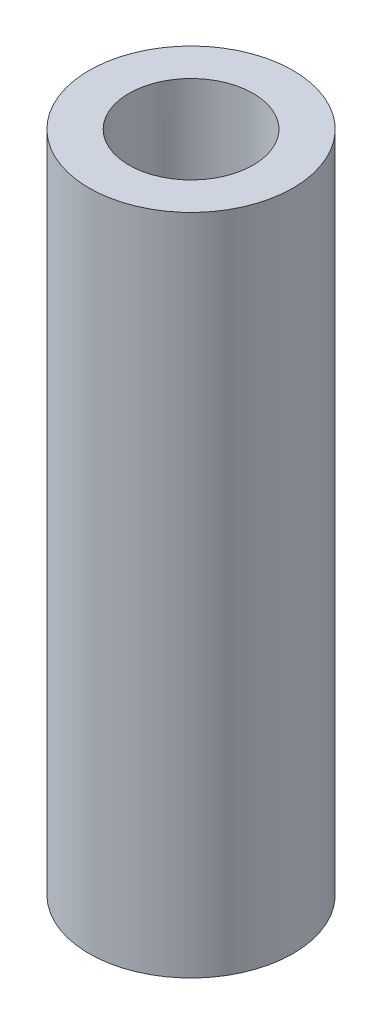
ISO-10303-21;
HEADER;
FILE_DESCRIPTION(('STEP AP214'),'2;1');
FILE_NAME('part.step','',(''),(''),'','','');
FILE_SCHEMA(('AUTOMOTIVE_DESIGN { 1 0 10303 214 1 1 1 1 }'));
ENDSEC;
DATA;
#1=APPLICATION_CONTEXT('core data for automotive mechanical design processes');
#2=APPLICATION_PROTOCOL_DEFINITION('international standard','automotive_design',2000,#1);
#3=PRODUCT_CONTEXT('',#1,'mechanical');
#4=PRODUCT('Part','Part','',(#3));
#5=PRODUCT_RELATED_PRODUCT_CATEGORY('part','',(#4));
#6=PRODUCT_DEFINITION_FORMATION('','',#4);
#7=PRODUCT_DEFINITION_CONTEXT('part definition',#1,'design');
#8=PRODUCT_DEFINITION('design','',#6,#7);
#9=PRODUCT_DEFINITION_SHAPE('','',#8);
#10=(LENGTH_UNIT() NAMED_UNIT(*) SI_UNIT(.MILLI.,.METRE.));
#11=(NAMED_UNIT(*) PLANE_ANGLE_UNIT() SI_UNIT($,.RADIAN.));
#12=(NAMED_UNIT(*) SI_UNIT($,.STERADIAN.) SOLID_ANGLE_UNIT());
#13=UNCERTAINTY_MEASURE_WITH_UNIT(LENGTH_MEASURE(1.E-05),#10,'distance_accuracy_value','');
#14=(GEOMETRIC_REPRESENTATION_CONTEXT(3) GLOBAL_UNCERTAINTY_ASSIGNED_CONTEXT((#13)) GLOBAL_UNIT_ASSIGNED_CONTEXT((#10,
#11,#12)) REPRESENTATION_CONTEXT('',''));
#15=CARTESIAN_POINT('',(0.,0.,0.));
#16=DIRECTION('',(0.,0.,1.));
#17=DIRECTION('',(1.,0.,0.));
#18=AXIS2_PLACEMENT_3D('',#15,#16,#17);
#19=CARTESIAN_POINT('',(0.,0.,0.));
#20=DIRECTION('',(0.,-1.,0.));
#21=DIRECTION('',(1.,0.,0.));
#22=AXIS2_PLACEMENT_3D('',#19,#20,#21);
#23=CYLINDRICAL_SURFACE('',#22,3.90525);
#24=CARTESIAN_POINT('',(0.,25.4,0.));
#25=DIRECTION('',(0.,-1.,0.));
#26=DIRECTION('',(1.,0.,0.));
#27=AXIS2_PLACEMENT_3D('',#24,#25,#26);
#28=CIRCLE('',#27,3.90525);
#29=CARTESIAN_POINT('',(3.90525,25.4,0.));
#30=VERTEX_POINT('',#29);
#31=EDGE_CURVE('E10',#30,#30,#28,.T.);
#32=ORIENTED_EDGE('',*,*,#31,.T.);
#33=EDGE_LOOP('',(#32));
#34=FACE_BOUND('',#33,.T.);
#35=CARTESIAN_POINT('',(0.,0.,0.));
#36=DIRECTION('',(0.,-1.,0.));
#37=DIRECTION('',(1.,0.,0.));
#38=AXIS2_PLACEMENT_3D('',#35,#36,#37);
#39=CIRCLE('',#38,3.90525);
#40=CARTESIAN_POINT('',(3.90525,0.,0.));
#41=VERTEX_POINT('',#40);
#42=EDGE_CURVE('E38',#41,#41,#39,.T.);
#43=ORIENTED_EDGE('',*,*,#42,.F.);
#44=EDGE_LOOP('',(#43));
#45=FACE_BOUND('',#44,.T.);
#46=ADVANCED_FACE('F32',(#34,#45),#23,.T.);
#47=CARTESIAN_POINT('',(2.38125,0.,0.));
#48=DIRECTION('',(0.,-1.,0.));
#49=DIRECTION('',(1.,0.,0.));
#50=AXIS2_PLACEMENT_3D('',#47,#48,#49);
#51=PLANE('',#50);
#52=ORIENTED_EDGE('',*,*,#42,.T.);
#53=EDGE_LOOP('',(#52));
#54=FACE_BOUND('',#53,.T.);
#55=CARTESIAN_POINT('',(0.,0.,0.));
#56=DIRECTION('',(0.,-1.,0.));
#57=DIRECTION('',(1.,0.,0.));
#58=AXIS2_PLACEMENT_3D('',#55,#56,#57);
#59=CIRCLE('',#58,2.38125);
#60=CARTESIAN_POINT('',(2.38125,0.,0.));
#61=VERTEX_POINT('',#60);
#62=EDGE_CURVE('E42',#61,#61,#59,.T.);
#63=ORIENTED_EDGE('',*,*,#62,.F.);
#64=EDGE_LOOP('',(#63));
#65=FACE_BOUND('',#64,.T.);
#66=ADVANCED_FACE('F56',(#54,#65),#51,.T.);
#67=CARTESIAN_POINT('',(0.,0.,0.));
#68=DIRECTION('',(0.,-1.,0.));
#69=DIRECTION('',(1.,0.,0.));
#70=AXIS2_PLACEMENT_3D('',#67,#68,#69);
#71=CYLINDRICAL_SURFACE('',#70,2.38125);
#72=ORIENTED_EDGE('',*,*,#62,.T.);
#73=EDGE_LOOP('',(#72));
#74=FACE_BOUND('',#73,.T.);
#75=CARTESIAN_POINT('',(0.,25.4,0.));
#76=DIRECTION('',(0.,-1.,0.));
#77=DIRECTION('',(0.,0.,-1.));
#78=AXIS2_PLACEMENT_3D('',#75,#76,#77);
#79=CIRCLE('',#78,2.38125);
#80=CARTESIAN_POINT('',(0.,25.4,-2.38125));
#81=VERTEX_POINT('',#80);
#82=EDGE_CURVE('E46',#81,#81,#79,.T.);
#83=ORIENTED_EDGE('',*,*,#82,.F.);
#84=EDGE_LOOP('',(#83));
#85=FACE_BOUND('',#84,.T.);
#86=ADVANCED_FACE('F54',(#74,#85),#71,.F.);
#87=CARTESIAN_POINT('',(-3.90525,25.4,-3.90525));
#88=DIRECTION('',(0.,-1.,0.));
#89=DIRECTION('',(0.,0.,-1.));
#90=AXIS2_PLACEMENT_3D('',#87,#88,#89);
#91=PLANE('',#90);
#92=ORIENTED_EDGE('',*,*,#31,.F.);
#93=EDGE_LOOP('',(#92));
#94=FACE_BOUND('',#93,.T.);
#95=ORIENTED_EDGE('',*,*,#82,.T.);
#96=EDGE_LOOP('',(#95));
#97=FACE_BOUND('',#96,.T.);
#98=ADVANCED_FACE('F52',(#94,#97),#91,.F.);
#99=CLOSED_SHELL('',(#46,#66,#86,#98));
#100=MANIFOLD_SOLID_BREP('B2',#99);
#101=ADVANCED_BREP_SHAPE_REPRESENTATION('',(#18,#100),#14);
#102=SHAPE_DEFINITION_REPRESENTATION(#9,#101);
ENDSEC;
END-ISO-10303-21;
